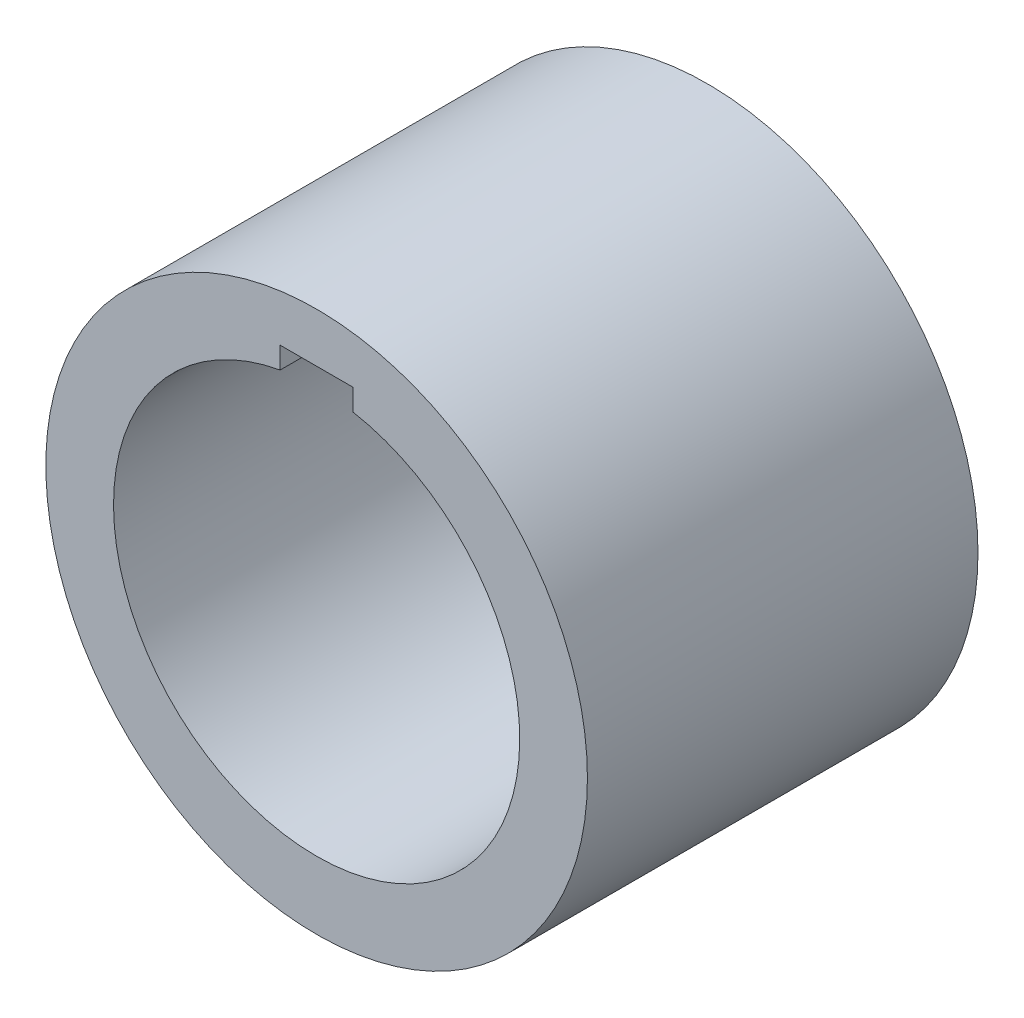
ISO-10303-21;
HEADER;
FILE_DESCRIPTION(('STEP AP214'),'2;1');
FILE_NAME('part.step','',(''),(''),'','','');
FILE_SCHEMA(('AUTOMOTIVE_DESIGN { 1 0 10303 214 1 1 1 1 }'));
ENDSEC;
DATA;
#1=APPLICATION_CONTEXT('core data for automotive mechanical design processes');
#2=APPLICATION_PROTOCOL_DEFINITION('international standard','automotive_design',2000,#1);
#3=PRODUCT_CONTEXT('',#1,'mechanical');
#4=PRODUCT('Part','Part','',(#3));
#5=PRODUCT_RELATED_PRODUCT_CATEGORY('part','',(#4));
#6=PRODUCT_DEFINITION_FORMATION('','',#4);
#7=PRODUCT_DEFINITION_CONTEXT('part definition',#1,'design');
#8=PRODUCT_DEFINITION('design','',#6,#7);
#9=PRODUCT_DEFINITION_SHAPE('','',#8);
#10=(LENGTH_UNIT() NAMED_UNIT(*) SI_UNIT(.MILLI.,.METRE.));
#11=(NAMED_UNIT(*) PLANE_ANGLE_UNIT() SI_UNIT($,.RADIAN.));
#12=(NAMED_UNIT(*) SI_UNIT($,.STERADIAN.) SOLID_ANGLE_UNIT());
#13=UNCERTAINTY_MEASURE_WITH_UNIT(LENGTH_MEASURE(1.E-05),#10,'distance_accuracy_value','');
#14=(GEOMETRIC_REPRESENTATION_CONTEXT(3) GLOBAL_UNCERTAINTY_ASSIGNED_CONTEXT((#13)) GLOBAL_UNIT_ASSIGNED_CONTEXT((#10,
#11,#12)) REPRESENTATION_CONTEXT('',''));
#15=CARTESIAN_POINT('',(0.,0.,0.));
#16=DIRECTION('',(0.,0.,1.));
#17=DIRECTION('',(1.,0.,0.));
#18=AXIS2_PLACEMENT_3D('',#15,#16,#17);
#19=CARTESIAN_POINT('',(0.,0.,15.));
#20=DIRECTION('',(0.,0.,1.));
#21=DIRECTION('',(1.,0.,0.));
#22=AXIS2_PLACEMENT_3D('',#19,#20,#21);
#23=PLANE('',#22);
#24=DIRECTION('',(0.,-1.,0.));
#25=VECTOR('',#24,1.);
#26=CARTESIAN_POINT('',(-1.4,5.7,15.));
#27=LINE('',#26,#25);
#28=CARTESIAN_POINT('',(-1.4,8.5,15.));
#29=VERTEX_POINT('',#28);
#30=CARTESIAN_POINT('',(-1.4,7.67333043730035,15.));
#31=VERTEX_POINT('',#30);
#32=EDGE_CURVE('E75',#29,#31,#27,.T.);
#33=ORIENTED_EDGE('',*,*,#32,.F.);
#34=DIRECTION('',(-1.,0.,0.));
#35=VECTOR('',#34,1.);
#36=CARTESIAN_POINT('',(1.4,8.5,15.));
#37=LINE('',#36,#35);
#38=CARTESIAN_POINT('',(1.4,8.5,15.));
#39=VERTEX_POINT('',#38);
#40=EDGE_CURVE('E106',#39,#29,#37,.T.);
#41=ORIENTED_EDGE('',*,*,#40,.F.);
#42=DIRECTION('',(0.,1.,0.));
#43=VECTOR('',#42,1.);
#44=CARTESIAN_POINT('',(1.4,5.7,15.));
#45=LINE('',#44,#43);
#46=CARTESIAN_POINT('',(1.4,7.67333043730035,15.));
#47=VERTEX_POINT('',#46);
#48=EDGE_CURVE('E86',#47,#39,#45,.T.);
#49=ORIENTED_EDGE('',*,*,#48,.F.);
#50=CARTESIAN_POINT('',(0.,0.,15.));
#51=DIRECTION('',(0.,0.,1.));
#52=DIRECTION('',(1.,0.,0.));
#53=AXIS2_PLACEMENT_3D('',#50,#51,#52);
#54=CIRCLE('',#53,7.8);
#55=EDGE_CURVE('E93',#31,#47,#54,.T.);
#56=ORIENTED_EDGE('',*,*,#55,.F.);
#57=EDGE_LOOP('',(#33,#41,#49,#56));
#58=FACE_BOUND('',#57,.T.);
#59=CARTESIAN_POINT('',(0.,0.,15.));
#60=DIRECTION('',(0.,0.,1.));
#61=DIRECTION('',(1.,0.,0.));
#62=AXIS2_PLACEMENT_3D('',#59,#60,#61);
#63=CIRCLE('',#62,10.4);
#64=CARTESIAN_POINT('',(10.4,0.,15.));
#65=VERTEX_POINT('',#64);
#66=EDGE_CURVE('E11',#65,#65,#63,.T.);
#67=ORIENTED_EDGE('',*,*,#66,.T.);
#68=EDGE_LOOP('',(#67));
#69=FACE_BOUND('',#68,.T.);
#70=ADVANCED_FACE('F35',(#58,#69),#23,.T.);
#71=CARTESIAN_POINT('',(0.,0.,0.));
#72=DIRECTION('',(0.,0.,1.));
#73=DIRECTION('',(1.,0.,0.));
#74=AXIS2_PLACEMENT_3D('',#71,#72,#73);
#75=PLANE('',#74);
#76=CARTESIAN_POINT('',(0.,0.,0.));
#77=DIRECTION('',(0.,0.,1.));
#78=DIRECTION('',(1.,0.,0.));
#79=AXIS2_PLACEMENT_3D('',#76,#77,#78);
#80=CIRCLE('',#79,10.4);
#81=CARTESIAN_POINT('',(10.4,0.,0.));
#82=VERTEX_POINT('',#81);
#83=EDGE_CURVE('E39',#82,#82,#80,.T.);
#84=ORIENTED_EDGE('',*,*,#83,.F.);
#85=EDGE_LOOP('',(#84));
#86=FACE_BOUND('',#85,.T.);
#87=DIRECTION('',(1.,0.,0.));
#88=VECTOR('',#87,1.);
#89=CARTESIAN_POINT('',(1.4,8.5,0.));
#90=LINE('',#89,#88);
#91=CARTESIAN_POINT('',(-1.4,8.5,0.));
#92=VERTEX_POINT('',#91);
#93=CARTESIAN_POINT('',(1.4,8.5,0.));
#94=VERTEX_POINT('',#93);
#95=EDGE_CURVE('E96',#92,#94,#90,.T.);
#96=ORIENTED_EDGE('',*,*,#95,.F.);
#97=DIRECTION('',(0.,1.,0.));
#98=VECTOR('',#97,1.);
#99=CARTESIAN_POINT('',(-1.4,5.7,0.));
#100=LINE('',#99,#98);
#101=CARTESIAN_POINT('',(-1.4,7.67333043730035,0.));
#102=VERTEX_POINT('',#101);
#103=EDGE_CURVE('E87',#102,#92,#100,.T.);
#104=ORIENTED_EDGE('',*,*,#103,.F.);
#105=CARTESIAN_POINT('',(0.,0.,0.));
#106=DIRECTION('',(0.,0.,1.));
#107=DIRECTION('',(1.,0.,0.));
#108=AXIS2_PLACEMENT_3D('',#105,#106,#107);
#109=CIRCLE('',#108,7.8);
#110=CARTESIAN_POINT('',(1.4,7.67333043730035,0.));
#111=VERTEX_POINT('',#110);
#112=EDGE_CURVE('E95',#102,#111,#109,.T.);
#113=ORIENTED_EDGE('',*,*,#112,.T.);
#114=DIRECTION('',(0.,-1.,0.));
#115=VECTOR('',#114,1.);
#116=CARTESIAN_POINT('',(1.4,5.7,0.));
#117=LINE('',#116,#115);
#118=EDGE_CURVE('E50',#94,#111,#117,.T.);
#119=ORIENTED_EDGE('',*,*,#118,.F.);
#120=EDGE_LOOP('',(#96,#104,#113,#119));
#121=FACE_BOUND('',#120,.T.);
#122=ADVANCED_FACE('F114',(#86,#121),#75,.F.);
#123=CARTESIAN_POINT('',(0.,0.,15.));
#124=DIRECTION('',(0.,0.,-1.));
#125=DIRECTION('',(-1.,0.,0.));
#126=AXIS2_PLACEMENT_3D('',#123,#124,#125);
#127=CYLINDRICAL_SURFACE('',#126,10.4);
#128=ORIENTED_EDGE('',*,*,#66,.F.);
#129=EDGE_LOOP('',(#128));
#130=FACE_BOUND('',#129,.T.);
#131=ORIENTED_EDGE('',*,*,#83,.T.);
#132=EDGE_LOOP('',(#131));
#133=FACE_BOUND('',#132,.T.);
#134=ADVANCED_FACE('F37',(#130,#133),#127,.T.);
#135=CARTESIAN_POINT('',(0.,0.,15.));
#136=DIRECTION('',(0.,0.,-1.));
#137=DIRECTION('',(-1.,0.,0.));
#138=AXIS2_PLACEMENT_3D('',#135,#136,#137);
#139=CYLINDRICAL_SURFACE('',#138,7.8);
#140=DIRECTION('',(0.,0.,-1.));
#141=VECTOR('',#140,1.);
#142=CARTESIAN_POINT('',(-1.4,7.67333043730035,15.));
#143=LINE('',#142,#141);
#144=EDGE_CURVE('E78',#102,#31,#143,.F.);
#145=ORIENTED_EDGE('',*,*,#144,.T.);
#146=ORIENTED_EDGE('',*,*,#55,.T.);
#147=DIRECTION('',(0.,0.,-1.));
#148=VECTOR('',#147,1.);
#149=CARTESIAN_POINT('',(1.4,7.67333043730035,15.));
#150=LINE('',#149,#148);
#151=EDGE_CURVE('E54',#47,#111,#150,.T.);
#152=ORIENTED_EDGE('',*,*,#151,.T.);
#153=ORIENTED_EDGE('',*,*,#112,.F.);
#154=EDGE_LOOP('',(#145,#146,#152,#153));
#155=FACE_BOUND('',#154,.T.);
#156=ADVANCED_FACE('F92',(#155),#139,.F.);
#157=CARTESIAN_POINT('',(-1.4,5.7,-0.000999999999999265));
#158=DIRECTION('',(-1.,0.,0.));
#159=DIRECTION('',(0.,0.,1.));
#160=AXIS2_PLACEMENT_3D('',#157,#158,#159);
#161=PLANE('',#160);
#162=ORIENTED_EDGE('',*,*,#103,.T.);
#163=DIRECTION('',(0.,0.,1.));
#164=VECTOR('',#163,1.);
#165=CARTESIAN_POINT('',(-1.4,8.5,-0.000999999999999265));
#166=LINE('',#165,#164);
#167=EDGE_CURVE('E81',#92,#29,#166,.T.);
#168=ORIENTED_EDGE('',*,*,#167,.T.);
#169=ORIENTED_EDGE('',*,*,#32,.T.);
#170=ORIENTED_EDGE('',*,*,#144,.F.);
#171=EDGE_LOOP('',(#162,#168,#169,#170));
#172=FACE_BOUND('',#171,.T.);
#173=ADVANCED_FACE('F77',(#172),#161,.F.);
#174=CARTESIAN_POINT('',(1.4,8.5,-0.000999999999999265));
#175=DIRECTION('',(0.,1.,0.));
#176=DIRECTION('',(0.,0.,1.));
#177=AXIS2_PLACEMENT_3D('',#174,#175,#176);
#178=PLANE('',#177);
#179=ORIENTED_EDGE('',*,*,#95,.T.);
#180=DIRECTION('',(0.,0.,1.));
#181=VECTOR('',#180,1.);
#182=CARTESIAN_POINT('',(1.4,8.5,-0.000999999999999265));
#183=LINE('',#182,#181);
#184=EDGE_CURVE('E104',#94,#39,#183,.T.);
#185=ORIENTED_EDGE('',*,*,#184,.T.);
#186=ORIENTED_EDGE('',*,*,#40,.T.);
#187=ORIENTED_EDGE('',*,*,#167,.F.);
#188=EDGE_LOOP('',(#179,#185,#186,#187));
#189=FACE_BOUND('',#188,.T.);
#190=ADVANCED_FACE('F116',(#189),#178,.F.);
#191=CARTESIAN_POINT('',(1.4,5.7,-0.000999999999999265));
#192=DIRECTION('',(1.,0.,0.));
#193=DIRECTION('',(0.,0.,-1.));
#194=AXIS2_PLACEMENT_3D('',#191,#192,#193);
#195=PLANE('',#194);
#196=ORIENTED_EDGE('',*,*,#118,.T.);
#197=ORIENTED_EDGE('',*,*,#151,.F.);
#198=ORIENTED_EDGE('',*,*,#48,.T.);
#199=ORIENTED_EDGE('',*,*,#184,.F.);
#200=EDGE_LOOP('',(#196,#197,#198,#199));
#201=FACE_BOUND('',#200,.T.);
#202=ADVANCED_FACE('F117',(#201),#195,.F.);
#203=CLOSED_SHELL('',(#70,#122,#134,#156,#173,#190,#202));
#204=MANIFOLD_SOLID_BREP('B2',#203);
#205=ADVANCED_BREP_SHAPE_REPRESENTATION('',(#18,#204),#14);
#206=SHAPE_DEFINITION_REPRESENTATION(#9,#205);
ENDSEC;
END-ISO-10303-21;
